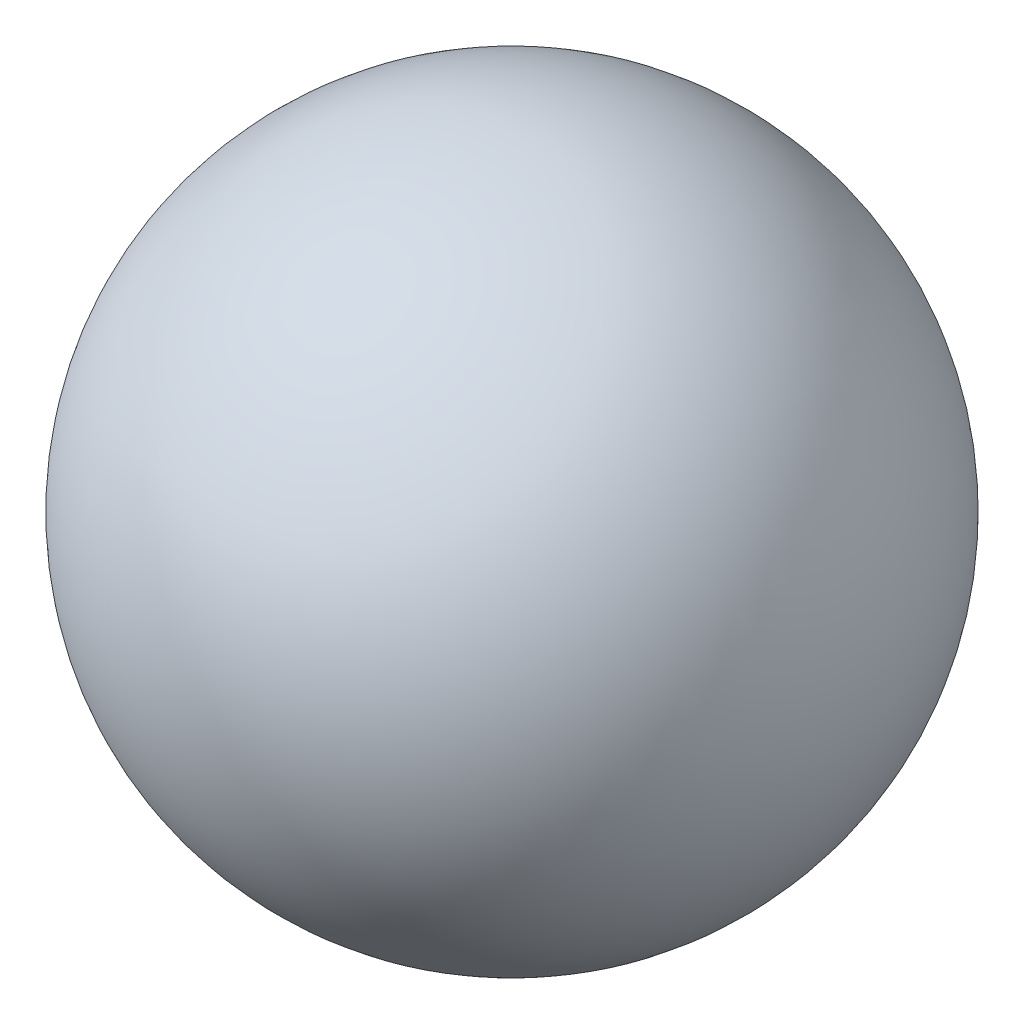
ISO-10303-21;
HEADER;
FILE_DESCRIPTION(('STEP AP214'),'2;1');
FILE_NAME('part.step','',(''),(''),'','','');
FILE_SCHEMA(('AUTOMOTIVE_DESIGN { 1 0 10303 214 1 1 1 1 }'));
ENDSEC;
DATA;
#1=APPLICATION_CONTEXT('core data for automotive mechanical design processes');
#2=APPLICATION_PROTOCOL_DEFINITION('international standard','automotive_design',2000,#1);
#3=PRODUCT_CONTEXT('',#1,'mechanical');
#4=PRODUCT('Part','Part','',(#3));
#5=PRODUCT_RELATED_PRODUCT_CATEGORY('part','',(#4));
#6=PRODUCT_DEFINITION_FORMATION('','',#4);
#7=PRODUCT_DEFINITION_CONTEXT('part definition',#1,'design');
#8=PRODUCT_DEFINITION('design','',#6,#7);
#9=PRODUCT_DEFINITION_SHAPE('','',#8);
#10=(LENGTH_UNIT() NAMED_UNIT(*) SI_UNIT(.MILLI.,.METRE.));
#11=(NAMED_UNIT(*) PLANE_ANGLE_UNIT() SI_UNIT($,.RADIAN.));
#12=(NAMED_UNIT(*) SI_UNIT($,.STERADIAN.) SOLID_ANGLE_UNIT());
#13=UNCERTAINTY_MEASURE_WITH_UNIT(LENGTH_MEASURE(1.E-05),#10,'distance_accuracy_value','');
#14=(GEOMETRIC_REPRESENTATION_CONTEXT(3) GLOBAL_UNCERTAINTY_ASSIGNED_CONTEXT((#13)) GLOBAL_UNIT_ASSIGNED_CONTEXT((#10,
#11,#12)) REPRESENTATION_CONTEXT('',''));
#15=CARTESIAN_POINT('',(0.,0.,0.));
#16=DIRECTION('',(0.,0.,1.));
#17=DIRECTION('',(1.,0.,0.));
#18=AXIS2_PLACEMENT_3D('',#15,#16,#17);
#19=CARTESIAN_POINT('',(0.,100.,0.));
#20=DIRECTION('',(0.,-1.,0.));
#21=DIRECTION('',(-1.,0.,0.));
#22=AXIS2_PLACEMENT_3D('',#19,#20,#21);
#23=SPHERICAL_SURFACE('',#22,100.);
#24=CARTESIAN_POINT('',(0.,0.,0.));
#25=VERTEX_POINT('',#24);
#26=VERTEX_LOOP('',#25);
#27=FACE_BOUND('',#26,.T.);
#28=ADVANCED_FACE('F29',(#27),#23,.T.);
#29=CLOSED_SHELL('',(#28));
#30=MANIFOLD_SOLID_BREP('B2',#29);
#31=ADVANCED_BREP_SHAPE_REPRESENTATION('',(#18,#30),#14);
#32=SHAPE_DEFINITION_REPRESENTATION(#9,#31);
ENDSEC;
END-ISO-10303-21;
